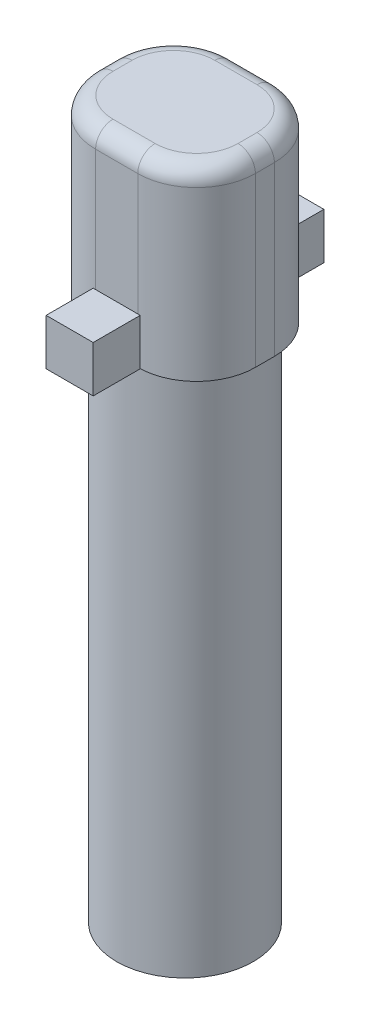
ISO-10303-21;
HEADER;
FILE_DESCRIPTION(('STEP AP214'),'2;1');
FILE_NAME('part.step','',(''),(''),'','','');
FILE_SCHEMA(('AUTOMOTIVE_DESIGN { 1 0 10303 214 1 1 1 1 }'));
ENDSEC;
DATA;
#1=APPLICATION_CONTEXT('core data for automotive mechanical design processes');
#2=APPLICATION_PROTOCOL_DEFINITION('international standard','automotive_design',2000,#1);
#3=PRODUCT_CONTEXT('',#1,'mechanical');
#4=PRODUCT('Part','Part','',(#3));
#5=PRODUCT_RELATED_PRODUCT_CATEGORY('part','',(#4));
#6=PRODUCT_DEFINITION_FORMATION('','',#4);
#7=PRODUCT_DEFINITION_CONTEXT('part definition',#1,'design');
#8=PRODUCT_DEFINITION('design','',#6,#7);
#9=PRODUCT_DEFINITION_SHAPE('','',#8);
#10=(LENGTH_UNIT() NAMED_UNIT(*) SI_UNIT(.MILLI.,.METRE.));
#11=(NAMED_UNIT(*) PLANE_ANGLE_UNIT() SI_UNIT($,.RADIAN.));
#12=(NAMED_UNIT(*) SI_UNIT($,.STERADIAN.) SOLID_ANGLE_UNIT());
#13=UNCERTAINTY_MEASURE_WITH_UNIT(LENGTH_MEASURE(1.E-05),#10,'distance_accuracy_value','');
#14=(GEOMETRIC_REPRESENTATION_CONTEXT(3) GLOBAL_UNCERTAINTY_ASSIGNED_CONTEXT((#13)) GLOBAL_UNIT_ASSIGNED_CONTEXT((#10,
#11,#12)) REPRESENTATION_CONTEXT('',''));
#15=CARTESIAN_POINT('',(0.,0.,0.));
#16=DIRECTION('',(0.,0.,1.));
#17=DIRECTION('',(1.,0.,0.));
#18=AXIS2_PLACEMENT_3D('',#15,#16,#17);
#19=CARTESIAN_POINT('',(0.,22.686,0.));
#20=DIRECTION('',(0.,-1.,0.));
#21=DIRECTION('',(0.,0.,-1.));
#22=AXIS2_PLACEMENT_3D('',#19,#20,#21);
#23=CYLINDRICAL_SURFACE('',#22,2.95);
#24=CARTESIAN_POINT('',(0.,22.686,0.));
#25=DIRECTION('',(0.,1.,0.));
#26=DIRECTION('',(0.,0.,1.));
#27=AXIS2_PLACEMENT_3D('',#24,#25,#26);
#28=CIRCLE('',#27,2.95);
#29=CARTESIAN_POINT('',(0.,22.686,2.95));
#30=VERTEX_POINT('',#29);
#31=EDGE_CURVE('E291',#30,#30,#28,.T.);
#32=ORIENTED_EDGE('',*,*,#31,.F.);
#33=EDGE_LOOP('',(#32));
#34=FACE_BOUND('',#33,.T.);
#35=CARTESIAN_POINT('',(0.,0.,0.));
#36=DIRECTION('',(0.,1.,0.));
#37=DIRECTION('',(0.,0.,1.));
#38=AXIS2_PLACEMENT_3D('',#35,#36,#37);
#39=CIRCLE('',#38,2.95);
#40=CARTESIAN_POINT('',(0.,0.,2.95));
#41=VERTEX_POINT('',#40);
#42=EDGE_CURVE('E290',#41,#41,#39,.T.);
#43=ORIENTED_EDGE('',*,*,#42,.T.);
#44=EDGE_LOOP('',(#43));
#45=FACE_BOUND('',#44,.T.);
#46=ADVANCED_FACE('F47',(#34,#45),#23,.T.);
#47=CARTESIAN_POINT('',(0.,0.,0.));
#48=DIRECTION('',(0.,1.,0.));
#49=DIRECTION('',(0.,0.,1.));
#50=AXIS2_PLACEMENT_3D('',#47,#48,#49);
#51=PLANE('',#50);
#52=ORIENTED_EDGE('',*,*,#42,.F.);
#53=EDGE_LOOP('',(#52));
#54=FACE_BOUND('',#53,.T.);
#55=ADVANCED_FACE('F505',(#54),#51,.F.);
#56=CARTESIAN_POINT('',(0.,22.686,0.));
#57=DIRECTION('',(0.,1.,0.));
#58=DIRECTION('',(0.,0.,1.));
#59=AXIS2_PLACEMENT_3D('',#56,#57,#58);
#60=PLANE('',#59);
#61=ORIENTED_EDGE('',*,*,#31,.T.);
#62=EDGE_LOOP('',(#61));
#63=FACE_BOUND('',#62,.T.);
#64=DIRECTION('',(1.,0.,0.));
#65=VECTOR('',#64,1.);
#66=CARTESIAN_POINT('',(0.,22.686,-2.95));
#67=LINE('',#66,#65);
#68=CARTESIAN_POINT('',(0.909999999999997,22.686,-2.95));
#69=VERTEX_POINT('',#68);
#70=CARTESIAN_POINT('',(1.016,22.686,-2.95));
#71=VERTEX_POINT('',#70);
#72=EDGE_CURVE('E222',#69,#71,#67,.T.);
#73=ORIENTED_EDGE('',*,*,#72,.F.);
#74=CARTESIAN_POINT('',(0.909999999999998,22.686,-0.41));
#75=DIRECTION('',(0.,1.,0.));
#76=DIRECTION('',(0.,0.,1.));
#77=AXIS2_PLACEMENT_3D('',#74,#75,#76);
#78=CIRCLE('',#77,2.54);
#79=CARTESIAN_POINT('',(3.45,22.686,-0.410000000000001));
#80=VERTEX_POINT('',#79);
#81=EDGE_CURVE('E322',#69,#80,#78,.F.);
#82=ORIENTED_EDGE('',*,*,#81,.T.);
#83=DIRECTION('',(0.,0.,-1.));
#84=VECTOR('',#83,1.);
#85=CARTESIAN_POINT('',(3.45,22.686,-2.95));
#86=LINE('',#85,#84);
#87=CARTESIAN_POINT('',(3.45,22.686,0.409999999999999));
#88=VERTEX_POINT('',#87);
#89=EDGE_CURVE('E282',#88,#80,#86,.T.);
#90=ORIENTED_EDGE('',*,*,#89,.F.);
#91=CARTESIAN_POINT('',(0.909999999999999,22.686,0.409999999999999));
#92=DIRECTION('',(0.,1.,0.));
#93=DIRECTION('',(0.,0.,1.));
#94=AXIS2_PLACEMENT_3D('',#91,#92,#93);
#95=CIRCLE('',#94,2.54);
#96=CARTESIAN_POINT('',(0.909999999999999,22.686,2.95));
#97=VERTEX_POINT('',#96);
#98=EDGE_CURVE('E319',#88,#97,#95,.F.);
#99=ORIENTED_EDGE('',*,*,#98,.T.);
#100=DIRECTION('',(-1.,0.,0.));
#101=VECTOR('',#100,1.);
#102=CARTESIAN_POINT('',(0.,22.686,2.95));
#103=LINE('',#102,#101);
#104=CARTESIAN_POINT('',(1.016,22.686,2.95));
#105=VERTEX_POINT('',#104);
#106=EDGE_CURVE('E260',#105,#97,#103,.T.);
#107=ORIENTED_EDGE('',*,*,#106,.F.);
#108=DIRECTION('',(0.,0.,-1.));
#109=VECTOR('',#108,1.);
#110=CARTESIAN_POINT('',(1.016,22.686,0.));
#111=LINE('',#110,#109);
#112=CARTESIAN_POINT('',(1.016,22.686,4.982));
#113=VERTEX_POINT('',#112);
#114=EDGE_CURVE('E264',#113,#105,#111,.T.);
#115=ORIENTED_EDGE('',*,*,#114,.F.);
#116=DIRECTION('',(1.,0.,0.));
#117=VECTOR('',#116,1.);
#118=CARTESIAN_POINT('',(0.,22.686,4.982));
#119=LINE('',#118,#117);
#120=CARTESIAN_POINT('',(-1.016,22.686,4.982));
#121=VERTEX_POINT('',#120);
#122=EDGE_CURVE('E252',#121,#113,#119,.T.);
#123=ORIENTED_EDGE('',*,*,#122,.F.);
#124=DIRECTION('',(0.,0.,1.));
#125=VECTOR('',#124,1.);
#126=CARTESIAN_POINT('',(-1.016,22.686,0.));
#127=LINE('',#126,#125);
#128=CARTESIAN_POINT('',(-1.016,22.686,2.95));
#129=VERTEX_POINT('',#128);
#130=EDGE_CURVE('E255',#129,#121,#127,.T.);
#131=ORIENTED_EDGE('',*,*,#130,.F.);
#132=CARTESIAN_POINT('',(-0.91,22.686,2.95));
#133=VERTEX_POINT('',#132);
#134=EDGE_CURVE('E259',#133,#129,#103,.T.);
#135=ORIENTED_EDGE('',*,*,#134,.F.);
#136=CARTESIAN_POINT('',(-0.910000000000001,22.686,0.409999999999999));
#137=DIRECTION('',(0.,1.,0.));
#138=DIRECTION('',(0.,0.,1.));
#139=AXIS2_PLACEMENT_3D('',#136,#137,#138);
#140=CIRCLE('',#139,2.54);
#141=CARTESIAN_POINT('',(-3.45,22.686,0.41));
#142=VERTEX_POINT('',#141);
#143=EDGE_CURVE('E305',#133,#142,#140,.F.);
#144=ORIENTED_EDGE('',*,*,#143,.T.);
#145=DIRECTION('',(0.,0.,1.));
#146=VECTOR('',#145,1.);
#147=CARTESIAN_POINT('',(-3.45,22.686,-2.95));
#148=LINE('',#147,#146);
#149=CARTESIAN_POINT('',(-3.45,22.686,-0.41));
#150=VERTEX_POINT('',#149);
#151=EDGE_CURVE('E286',#150,#142,#148,.T.);
#152=ORIENTED_EDGE('',*,*,#151,.F.);
#153=CARTESIAN_POINT('',(-0.910000000000001,22.686,-0.41));
#154=DIRECTION('',(0.,1.,0.));
#155=DIRECTION('',(0.,0.,1.));
#156=AXIS2_PLACEMENT_3D('',#153,#154,#155);
#157=CIRCLE('',#156,2.54);
#158=CARTESIAN_POINT('',(-0.910000000000001,22.686,-2.95));
#159=VERTEX_POINT('',#158);
#160=EDGE_CURVE('E308',#150,#159,#157,.F.);
#161=ORIENTED_EDGE('',*,*,#160,.T.);
#162=CARTESIAN_POINT('',(-1.016,22.686,-2.95));
#163=VERTEX_POINT('',#162);
#164=EDGE_CURVE('E461',#163,#159,#67,.T.);
#165=ORIENTED_EDGE('',*,*,#164,.F.);
#166=DIRECTION('',(0.,0.,1.));
#167=VECTOR('',#166,1.);
#168=CARTESIAN_POINT('',(-1.016,22.686,0.));
#169=LINE('',#168,#167);
#170=CARTESIAN_POINT('',(-1.016,22.686,-4.982));
#171=VERTEX_POINT('',#170);
#172=EDGE_CURVE('E207',#171,#163,#169,.T.);
#173=ORIENTED_EDGE('',*,*,#172,.F.);
#174=DIRECTION('',(-1.,0.,0.));
#175=VECTOR('',#174,1.);
#176=CARTESIAN_POINT('',(0.,22.686,-4.982));
#177=LINE('',#176,#175);
#178=CARTESIAN_POINT('',(1.016,22.686,-4.982));
#179=VERTEX_POINT('',#178);
#180=EDGE_CURVE('E466',#179,#171,#177,.T.);
#181=ORIENTED_EDGE('',*,*,#180,.F.);
#182=DIRECTION('',(0.,0.,-1.));
#183=VECTOR('',#182,1.);
#184=CARTESIAN_POINT('',(1.016,22.686,0.));
#185=LINE('',#184,#183);
#186=EDGE_CURVE('E464',#71,#179,#185,.T.);
#187=ORIENTED_EDGE('',*,*,#186,.F.);
#188=EDGE_LOOP('',(#73,#82,#90,#99,#107,#115,#123,#131,#135,#144,#152,#161,#165,#173,#181,#187));
#189=FACE_BOUND('',#188,.T.);
#190=ADVANCED_FACE('F438',(#63,#189),#60,.F.);
#191=CARTESIAN_POINT('',(3.45,30.686,-2.95));
#192=DIRECTION('',(-1.,0.,0.));
#193=DIRECTION('',(0.,0.,1.));
#194=AXIS2_PLACEMENT_3D('',#191,#192,#193);
#195=PLANE('',#194);
#196=DIRECTION('',(0.,-1.,0.));
#197=VECTOR('',#196,1.);
#198=CARTESIAN_POINT('',(3.45,30.686,-0.410000000000001));
#199=LINE('',#198,#197);
#200=CARTESIAN_POINT('',(3.45,29.936,-0.410000000000001));
#201=VERTEX_POINT('',#200);
#202=EDGE_CURVE('E328',#80,#201,#199,.F.);
#203=ORIENTED_EDGE('',*,*,#202,.T.);
#204=DIRECTION('',(0.,0.,-1.));
#205=VECTOR('',#204,1.);
#206=CARTESIAN_POINT('',(3.45,29.936,0.409999999999999));
#207=LINE('',#206,#205);
#208=CARTESIAN_POINT('',(3.45,29.936,0.409999999999999));
#209=VERTEX_POINT('',#208);
#210=EDGE_CURVE('E367',#201,#209,#207,.F.);
#211=ORIENTED_EDGE('',*,*,#210,.T.);
#212=DIRECTION('',(0.,-1.,0.));
#213=VECTOR('',#212,1.);
#214=CARTESIAN_POINT('',(3.45,30.686,0.409999999999999));
#215=LINE('',#214,#213);
#216=EDGE_CURVE('E325',#209,#88,#215,.T.);
#217=ORIENTED_EDGE('',*,*,#216,.T.);
#218=ORIENTED_EDGE('',*,*,#89,.T.);
#219=EDGE_LOOP('',(#203,#211,#217,#218));
#220=FACE_BOUND('',#219,.T.);
#221=ADVANCED_FACE('F583',(#220),#195,.F.);
#222=CARTESIAN_POINT('',(-3.45,30.686,-2.95));
#223=DIRECTION('',(0.,0.,1.));
#224=DIRECTION('',(1.,0.,0.));
#225=AXIS2_PLACEMENT_3D('',#222,#223,#224);
#226=PLANE('',#225);
#227=DIRECTION('',(0.,-1.,0.));
#228=VECTOR('',#227,1.);
#229=CARTESIAN_POINT('',(0.909999999999998,30.686,-2.95));
#230=LINE('',#229,#228);
#231=CARTESIAN_POINT('',(0.909999999999998,29.936,-2.95));
#232=VERTEX_POINT('',#231);
#233=CARTESIAN_POINT('',(0.909999999999998,24.686,-2.95));
#234=VERTEX_POINT('',#233);
#235=EDGE_CURVE('E311',#232,#234,#230,.T.);
#236=ORIENTED_EDGE('',*,*,#235,.T.);
#237=DIRECTION('',(1.,0.,0.));
#238=VECTOR('',#237,1.);
#239=CARTESIAN_POINT('',(0.,24.686,-2.95));
#240=LINE('',#239,#238);
#241=CARTESIAN_POINT('',(-0.910000000000001,24.686,-2.95));
#242=VERTEX_POINT('',#241);
#243=EDGE_CURVE('E65',#242,#234,#240,.T.);
#244=ORIENTED_EDGE('',*,*,#243,.F.);
#245=DIRECTION('',(0.,-1.,0.));
#246=VECTOR('',#245,1.);
#247=CARTESIAN_POINT('',(-0.910000000000001,30.686,-2.95));
#248=LINE('',#247,#246);
#249=CARTESIAN_POINT('',(-0.910000000000001,29.936,-2.95));
#250=VERTEX_POINT('',#249);
#251=EDGE_CURVE('E314',#242,#250,#248,.F.);
#252=ORIENTED_EDGE('',*,*,#251,.T.);
#253=DIRECTION('',(-1.,0.,0.));
#254=VECTOR('',#253,1.);
#255=CARTESIAN_POINT('',(0.909999999999998,29.936,-2.95));
#256=LINE('',#255,#254);
#257=EDGE_CURVE('E378',#250,#232,#256,.F.);
#258=ORIENTED_EDGE('',*,*,#257,.T.);
#259=EDGE_LOOP('',(#236,#244,#252,#258));
#260=FACE_BOUND('',#259,.T.);
#261=ADVANCED_FACE('F577',(#260),#226,.F.);
#262=CARTESIAN_POINT('',(-3.45,30.686,-2.95));
#263=DIRECTION('',(1.,0.,0.));
#264=DIRECTION('',(0.,0.,-1.));
#265=AXIS2_PLACEMENT_3D('',#262,#263,#264);
#266=PLANE('',#265);
#267=DIRECTION('',(0.,-1.,0.));
#268=VECTOR('',#267,1.);
#269=CARTESIAN_POINT('',(-3.45,30.686,0.41));
#270=LINE('',#269,#268);
#271=CARTESIAN_POINT('',(-3.45,29.936,0.41));
#272=VERTEX_POINT('',#271);
#273=EDGE_CURVE('E295',#142,#272,#270,.F.);
#274=ORIENTED_EDGE('',*,*,#273,.T.);
#275=DIRECTION('',(0.,0.,1.));
#276=VECTOR('',#275,1.);
#277=CARTESIAN_POINT('',(-3.45,29.936,-0.41));
#278=LINE('',#277,#276);
#279=CARTESIAN_POINT('',(-3.45,29.936,-0.41));
#280=VERTEX_POINT('',#279);
#281=EDGE_CURVE('E385',#272,#280,#278,.F.);
#282=ORIENTED_EDGE('',*,*,#281,.T.);
#283=DIRECTION('',(0.,-1.,0.));
#284=VECTOR('',#283,1.);
#285=CARTESIAN_POINT('',(-3.45,30.686,-0.41));
#286=LINE('',#285,#284);
#287=EDGE_CURVE('E302',#280,#150,#286,.T.);
#288=ORIENTED_EDGE('',*,*,#287,.T.);
#289=ORIENTED_EDGE('',*,*,#151,.T.);
#290=EDGE_LOOP('',(#274,#282,#288,#289));
#291=FACE_BOUND('',#290,.T.);
#292=ADVANCED_FACE('F427',(#291),#266,.F.);
#293=CARTESIAN_POINT('',(-3.45,30.686,2.95));
#294=DIRECTION('',(0.,0.,-1.));
#295=DIRECTION('',(-1.,0.,0.));
#296=AXIS2_PLACEMENT_3D('',#293,#294,#295);
#297=PLANE('',#296);
#298=DIRECTION('',(0.,-1.,0.));
#299=VECTOR('',#298,1.);
#300=CARTESIAN_POINT('',(-0.910000000000001,30.686,2.95));
#301=LINE('',#300,#299);
#302=CARTESIAN_POINT('',(-0.910000000000001,29.936,2.95));
#303=VERTEX_POINT('',#302);
#304=CARTESIAN_POINT('',(-0.910000000000001,24.686,2.95));
#305=VERTEX_POINT('',#304);
#306=EDGE_CURVE('E333',#303,#305,#301,.T.);
#307=ORIENTED_EDGE('',*,*,#306,.T.);
#308=DIRECTION('',(-1.,0.,0.));
#309=VECTOR('',#308,1.);
#310=CARTESIAN_POINT('',(0.,24.686,2.95));
#311=LINE('',#310,#309);
#312=CARTESIAN_POINT('',(0.909999999999999,24.686,2.95));
#313=VERTEX_POINT('',#312);
#314=EDGE_CURVE('E278',#313,#305,#311,.T.);
#315=ORIENTED_EDGE('',*,*,#314,.F.);
#316=DIRECTION('',(0.,-1.,0.));
#317=VECTOR('',#316,1.);
#318=CARTESIAN_POINT('',(0.909999999999999,30.686,2.95));
#319=LINE('',#318,#317);
#320=CARTESIAN_POINT('',(0.909999999999999,29.936,2.95));
#321=VERTEX_POINT('',#320);
#322=EDGE_CURVE('E337',#313,#321,#319,.F.);
#323=ORIENTED_EDGE('',*,*,#322,.T.);
#324=DIRECTION('',(1.,0.,0.));
#325=VECTOR('',#324,1.);
#326=CARTESIAN_POINT('',(-0.910000000000001,29.936,2.95));
#327=LINE('',#326,#325);
#328=EDGE_CURVE('E11',#321,#303,#327,.F.);
#329=ORIENTED_EDGE('',*,*,#328,.T.);
#330=EDGE_LOOP('',(#307,#315,#323,#329));
#331=FACE_BOUND('',#330,.T.);
#332=ADVANCED_FACE('F446',(#331),#297,.F.);
#333=CARTESIAN_POINT('',(0.,30.686,0.));
#334=DIRECTION('',(0.,1.,0.));
#335=DIRECTION('',(0.,0.,1.));
#336=AXIS2_PLACEMENT_3D('',#333,#334,#335);
#337=PLANE('',#336);
#338=CARTESIAN_POINT('',(0.909999999999999,30.686,0.409999999999999));
#339=DIRECTION('',(0.,1.,0.));
#340=DIRECTION('',(0.,0.,1.));
#341=AXIS2_PLACEMENT_3D('',#338,#339,#340);
#342=CIRCLE('',#341,1.79);
#343=CARTESIAN_POINT('',(0.909999999999999,30.686,2.2));
#344=VERTEX_POINT('',#343);
#345=CARTESIAN_POINT('',(2.7,30.686,0.409999999999999));
#346=VERTEX_POINT('',#345);
#347=EDGE_CURVE('E360',#344,#346,#342,.T.);
#348=ORIENTED_EDGE('',*,*,#347,.T.);
#349=DIRECTION('',(0.,0.,-1.));
#350=VECTOR('',#349,1.);
#351=CARTESIAN_POINT('',(2.7,30.686,-0.410000000000001));
#352=LINE('',#351,#350);
#353=CARTESIAN_POINT('',(2.7,30.686,-0.410000000000001));
#354=VERTEX_POINT('',#353);
#355=EDGE_CURVE('E363',#346,#354,#352,.T.);
#356=ORIENTED_EDGE('',*,*,#355,.T.);
#357=CARTESIAN_POINT('',(0.909999999999998,30.686,-0.41));
#358=DIRECTION('',(0.,1.,0.));
#359=DIRECTION('',(0.,0.,1.));
#360=AXIS2_PLACEMENT_3D('',#357,#358,#359);
#361=CIRCLE('',#360,1.79);
#362=CARTESIAN_POINT('',(0.909999999999998,30.686,-2.2));
#363=VERTEX_POINT('',#362);
#364=EDGE_CURVE('E357',#354,#363,#361,.T.);
#365=ORIENTED_EDGE('',*,*,#364,.T.);
#366=DIRECTION('',(-1.,0.,0.));
#367=VECTOR('',#366,1.);
#368=CARTESIAN_POINT('',(-0.910000000000001,30.686,-2.2));
#369=LINE('',#368,#367);
#370=CARTESIAN_POINT('',(-0.910000000000001,30.686,-2.2));
#371=VERTEX_POINT('',#370);
#372=EDGE_CURVE('E354',#363,#371,#369,.T.);
#373=ORIENTED_EDGE('',*,*,#372,.T.);
#374=CARTESIAN_POINT('',(-0.910000000000001,30.686,-0.41));
#375=DIRECTION('',(0.,1.,0.));
#376=DIRECTION('',(0.,0.,1.));
#377=AXIS2_PLACEMENT_3D('',#374,#375,#376);
#378=CIRCLE('',#377,1.79);
#379=CARTESIAN_POINT('',(-2.7,30.686,-0.41));
#380=VERTEX_POINT('',#379);
#381=EDGE_CURVE('E351',#371,#380,#378,.T.);
#382=ORIENTED_EDGE('',*,*,#381,.T.);
#383=DIRECTION('',(0.,0.,1.));
#384=VECTOR('',#383,1.);
#385=CARTESIAN_POINT('',(-2.7,30.686,0.41));
#386=LINE('',#385,#384);
#387=CARTESIAN_POINT('',(-2.7,30.686,0.41));
#388=VERTEX_POINT('',#387);
#389=EDGE_CURVE('E348',#380,#388,#386,.T.);
#390=ORIENTED_EDGE('',*,*,#389,.T.);
#391=CARTESIAN_POINT('',(-0.910000000000001,30.686,0.409999999999999));
#392=DIRECTION('',(0.,1.,0.));
#393=DIRECTION('',(0.,0.,1.));
#394=AXIS2_PLACEMENT_3D('',#391,#392,#393);
#395=CIRCLE('',#394,1.79);
#396=CARTESIAN_POINT('',(-0.910000000000001,30.686,2.2));
#397=VERTEX_POINT('',#396);
#398=EDGE_CURVE('E345',#388,#397,#395,.T.);
#399=ORIENTED_EDGE('',*,*,#398,.T.);
#400=DIRECTION('',(1.,0.,0.));
#401=VECTOR('',#400,1.);
#402=CARTESIAN_POINT('',(0.909999999999999,30.686,2.2));
#403=LINE('',#402,#401);
#404=EDGE_CURVE('E342',#397,#344,#403,.T.);
#405=ORIENTED_EDGE('',*,*,#404,.T.);
#406=EDGE_LOOP('',(#348,#356,#365,#373,#382,#390,#399,#405));
#407=FACE_BOUND('',#406,.T.);
#408=ADVANCED_FACE('F522',(#407),#337,.T.);
#409=CARTESIAN_POINT('',(-0.910000000000001,30.686,-0.41));
#410=DIRECTION('',(0.,-1.,0.));
#411=DIRECTION('',(0.,0.,-1.));
#412=AXIS2_PLACEMENT_3D('',#409,#410,#411);
#413=CYLINDRICAL_SURFACE('',#412,2.54);
#414=ORIENTED_EDGE('',*,*,#287,.F.);
#415=CARTESIAN_POINT('',(-0.910000000000001,29.936,-0.41));
#416=DIRECTION('',(0.,1.,0.));
#417=DIRECTION('',(0.,0.,1.));
#418=AXIS2_PLACEMENT_3D('',#415,#416,#417);
#419=CIRCLE('',#418,2.54);
#420=EDGE_CURVE('E381',#280,#250,#419,.F.);
#421=ORIENTED_EDGE('',*,*,#420,.T.);
#422=ORIENTED_EDGE('',*,*,#251,.F.);
#423=EDGE_CURVE('E315',#159,#242,#248,.F.);
#424=ORIENTED_EDGE('',*,*,#423,.F.);
#425=ORIENTED_EDGE('',*,*,#160,.F.);
#426=EDGE_LOOP('',(#414,#421,#422,#424,#425));
#427=FACE_BOUND('',#426,.T.);
#428=ADVANCED_FACE('F431',(#427),#413,.T.);
#429=CARTESIAN_POINT('',(0.909999999999998,30.686,-0.41));
#430=DIRECTION('',(0.,-1.,0.));
#431=DIRECTION('',(0.,0.,-1.));
#432=AXIS2_PLACEMENT_3D('',#429,#430,#431);
#433=CYLINDRICAL_SURFACE('',#432,2.54);
#434=ORIENTED_EDGE('',*,*,#235,.F.);
#435=CARTESIAN_POINT('',(0.909999999999998,29.936,-0.41));
#436=DIRECTION('',(0.,1.,0.));
#437=DIRECTION('',(0.,0.,1.));
#438=AXIS2_PLACEMENT_3D('',#435,#436,#437);
#439=CIRCLE('',#438,2.54);
#440=EDGE_CURVE('E375',#232,#201,#439,.F.);
#441=ORIENTED_EDGE('',*,*,#440,.T.);
#442=ORIENTED_EDGE('',*,*,#202,.F.);
#443=ORIENTED_EDGE('',*,*,#81,.F.);
#444=EDGE_CURVE('E73',#234,#69,#230,.T.);
#445=ORIENTED_EDGE('',*,*,#444,.F.);
#446=EDGE_LOOP('',(#434,#441,#442,#443,#445));
#447=FACE_BOUND('',#446,.T.);
#448=ADVANCED_FACE('F521',(#447),#433,.T.);
#449=CARTESIAN_POINT('',(0.909999999999999,30.686,0.409999999999999));
#450=DIRECTION('',(0.,-1.,0.));
#451=DIRECTION('',(0.,0.,-1.));
#452=AXIS2_PLACEMENT_3D('',#449,#450,#451);
#453=CYLINDRICAL_SURFACE('',#452,2.54);
#454=ORIENTED_EDGE('',*,*,#216,.F.);
#455=CARTESIAN_POINT('',(0.909999999999999,29.936,0.409999999999999));
#456=DIRECTION('',(0.,1.,0.));
#457=DIRECTION('',(0.,0.,1.));
#458=AXIS2_PLACEMENT_3D('',#455,#456,#457);
#459=CIRCLE('',#458,2.54);
#460=EDGE_CURVE('E371',#209,#321,#459,.F.);
#461=ORIENTED_EDGE('',*,*,#460,.T.);
#462=ORIENTED_EDGE('',*,*,#322,.F.);
#463=EDGE_CURVE('E338',#97,#313,#319,.F.);
#464=ORIENTED_EDGE('',*,*,#463,.F.);
#465=ORIENTED_EDGE('',*,*,#98,.F.);
#466=EDGE_LOOP('',(#454,#461,#462,#464,#465));
#467=FACE_BOUND('',#466,.T.);
#468=ADVANCED_FACE('F525',(#467),#453,.T.);
#469=CARTESIAN_POINT('',(-0.910000000000001,30.686,0.409999999999999));
#470=DIRECTION('',(0.,-1.,0.));
#471=DIRECTION('',(0.,0.,-1.));
#472=AXIS2_PLACEMENT_3D('',#469,#470,#471);
#473=CYLINDRICAL_SURFACE('',#472,2.54);
#474=ORIENTED_EDGE('',*,*,#306,.F.);
#475=CARTESIAN_POINT('',(-0.910000000000001,29.936,0.409999999999999));
#476=DIRECTION('',(0.,1.,0.));
#477=DIRECTION('',(0.,0.,1.));
#478=AXIS2_PLACEMENT_3D('',#475,#476,#477);
#479=CIRCLE('',#478,2.54);
#480=EDGE_CURVE('E57',#303,#272,#479,.F.);
#481=ORIENTED_EDGE('',*,*,#480,.T.);
#482=ORIENTED_EDGE('',*,*,#273,.F.);
#483=ORIENTED_EDGE('',*,*,#143,.F.);
#484=EDGE_CURVE('E332',#305,#133,#301,.T.);
#485=ORIENTED_EDGE('',*,*,#484,.F.);
#486=EDGE_LOOP('',(#474,#481,#482,#483,#485));
#487=FACE_BOUND('',#486,.T.);
#488=ADVANCED_FACE('F442',(#487),#473,.T.);
#489=CARTESIAN_POINT('',(-2.7,29.936,0.));
#490=DIRECTION('',(0.,0.,-1.));
#491=DIRECTION('',(-1.,0.,0.));
#492=AXIS2_PLACEMENT_3D('',#489,#490,#491);
#493=CYLINDRICAL_SURFACE('',#492,0.75);
#494=CARTESIAN_POINT('',(-2.7,29.936,-0.41));
#495=DIRECTION('',(0.,0.,-1.));
#496=DIRECTION('',(-1.,0.,0.));
#497=AXIS2_PLACEMENT_3D('',#494,#495,#496);
#498=CIRCLE('',#497,0.75);
#499=EDGE_CURVE('E407',#280,#380,#498,.T.);
#500=ORIENTED_EDGE('',*,*,#499,.F.);
#501=ORIENTED_EDGE('',*,*,#281,.F.);
#502=CARTESIAN_POINT('',(-2.7,29.936,0.41));
#503=DIRECTION('',(0.,0.,1.));
#504=DIRECTION('',(1.,0.,0.));
#505=AXIS2_PLACEMENT_3D('',#502,#503,#504);
#506=CIRCLE('',#505,0.75);
#507=EDGE_CURVE('E51',#388,#272,#506,.T.);
#508=ORIENTED_EDGE('',*,*,#507,.F.);
#509=ORIENTED_EDGE('',*,*,#389,.F.);
#510=EDGE_LOOP('',(#500,#501,#508,#509));
#511=FACE_BOUND('',#510,.T.);
#512=ADVANCED_FACE('F49',(#511),#493,.T.);
#513=CARTESIAN_POINT('',(-0.910000000000001,29.936,0.409999999999999));
#514=DIRECTION('',(0.,1.,0.));
#515=DIRECTION('',(0.,0.,1.));
#516=AXIS2_PLACEMENT_3D('',#513,#514,#515);
#517=TOROIDAL_SURFACE('',#516,1.79,0.75);
#518=ORIENTED_EDGE('',*,*,#507,.T.);
#519=ORIENTED_EDGE('',*,*,#480,.F.);
#520=CARTESIAN_POINT('',(-0.910000000000001,29.936,2.2));
#521=DIRECTION('',(1.,0.,0.));
#522=DIRECTION('',(0.,0.,-1.));
#523=AXIS2_PLACEMENT_3D('',#520,#521,#522);
#524=CIRCLE('',#523,0.75);
#525=EDGE_CURVE('E404',#397,#303,#524,.T.);
#526=ORIENTED_EDGE('',*,*,#525,.F.);
#527=ORIENTED_EDGE('',*,*,#398,.F.);
#528=EDGE_LOOP('',(#518,#519,#526,#527));
#529=FACE_BOUND('',#528,.T.);
#530=ADVANCED_FACE('F420',(#529),#517,.T.);
#531=CARTESIAN_POINT('',(-0.910000000000001,29.936,-0.41));
#532=DIRECTION('',(0.,1.,0.));
#533=DIRECTION('',(0.,0.,1.));
#534=AXIS2_PLACEMENT_3D('',#531,#532,#533);
#535=TOROIDAL_SURFACE('',#534,1.79,0.75);
#536=ORIENTED_EDGE('',*,*,#499,.T.);
#537=ORIENTED_EDGE('',*,*,#381,.F.);
#538=CARTESIAN_POINT('',(-0.910000000000001,29.936,-2.2));
#539=DIRECTION('',(1.,0.,0.));
#540=DIRECTION('',(0.,0.,-1.));
#541=AXIS2_PLACEMENT_3D('',#538,#539,#540);
#542=CIRCLE('',#541,0.75);
#543=EDGE_CURVE('E400',#250,#371,#542,.T.);
#544=ORIENTED_EDGE('',*,*,#543,.F.);
#545=ORIENTED_EDGE('',*,*,#420,.F.);
#546=EDGE_LOOP('',(#536,#537,#544,#545));
#547=FACE_BOUND('',#546,.T.);
#548=ADVANCED_FACE('F550',(#547),#535,.T.);
#549=CARTESIAN_POINT('',(0.,29.936,2.2));
#550=DIRECTION('',(-1.,0.,0.));
#551=DIRECTION('',(0.,0.,1.));
#552=AXIS2_PLACEMENT_3D('',#549,#550,#551);
#553=CYLINDRICAL_SURFACE('',#552,0.75);
#554=ORIENTED_EDGE('',*,*,#525,.T.);
#555=ORIENTED_EDGE('',*,*,#328,.F.);
#556=CARTESIAN_POINT('',(0.909999999999999,29.936,2.2));
#557=DIRECTION('',(1.,0.,0.));
#558=DIRECTION('',(0.,0.,-1.));
#559=AXIS2_PLACEMENT_3D('',#556,#557,#558);
#560=CIRCLE('',#559,0.75);
#561=EDGE_CURVE('E396',#344,#321,#560,.T.);
#562=ORIENTED_EDGE('',*,*,#561,.F.);
#563=ORIENTED_EDGE('',*,*,#404,.F.);
#564=EDGE_LOOP('',(#554,#555,#562,#563));
#565=FACE_BOUND('',#564,.T.);
#566=ADVANCED_FACE('F546',(#565),#553,.T.);
#567=CARTESIAN_POINT('',(0.,29.936,-2.2));
#568=DIRECTION('',(1.,0.,0.));
#569=DIRECTION('',(0.,0.,-1.));
#570=AXIS2_PLACEMENT_3D('',#567,#568,#569);
#571=CYLINDRICAL_SURFACE('',#570,0.75);
#572=ORIENTED_EDGE('',*,*,#543,.T.);
#573=ORIENTED_EDGE('',*,*,#372,.F.);
#574=CARTESIAN_POINT('',(0.909999999999998,29.936,-2.2));
#575=DIRECTION('',(1.,0.,0.));
#576=DIRECTION('',(0.,0.,-1.));
#577=AXIS2_PLACEMENT_3D('',#574,#575,#576);
#578=CIRCLE('',#577,0.75);
#579=EDGE_CURVE('E392',#232,#363,#578,.T.);
#580=ORIENTED_EDGE('',*,*,#579,.F.);
#581=ORIENTED_EDGE('',*,*,#257,.F.);
#582=EDGE_LOOP('',(#572,#573,#580,#581));
#583=FACE_BOUND('',#582,.T.);
#584=ADVANCED_FACE('F542',(#583),#571,.T.);
#585=CARTESIAN_POINT('',(0.909999999999999,29.936,0.409999999999999));
#586=DIRECTION('',(0.,1.,0.));
#587=DIRECTION('',(0.,0.,1.));
#588=AXIS2_PLACEMENT_3D('',#585,#586,#587);
#589=TOROIDAL_SURFACE('',#588,1.79,0.75);
#590=ORIENTED_EDGE('',*,*,#561,.T.);
#591=ORIENTED_EDGE('',*,*,#460,.F.);
#592=CARTESIAN_POINT('',(2.7,29.936,0.409999999999999));
#593=DIRECTION('',(0.,0.,-1.));
#594=DIRECTION('',(-1.,0.,0.));
#595=AXIS2_PLACEMENT_3D('',#592,#593,#594);
#596=CIRCLE('',#595,0.75);
#597=EDGE_CURVE('E229',#346,#209,#596,.T.);
#598=ORIENTED_EDGE('',*,*,#597,.F.);
#599=ORIENTED_EDGE('',*,*,#347,.F.);
#600=EDGE_LOOP('',(#590,#591,#598,#599));
#601=FACE_BOUND('',#600,.T.);
#602=ADVANCED_FACE('F538',(#601),#589,.T.);
#603=CARTESIAN_POINT('',(0.909999999999998,29.936,-0.41));
#604=DIRECTION('',(0.,1.,0.));
#605=DIRECTION('',(0.,0.,1.));
#606=AXIS2_PLACEMENT_3D('',#603,#604,#605);
#607=TOROIDAL_SURFACE('',#606,1.79,0.75);
#608=ORIENTED_EDGE('',*,*,#579,.T.);
#609=ORIENTED_EDGE('',*,*,#364,.F.);
#610=CARTESIAN_POINT('',(2.7,29.936,-0.410000000000001));
#611=DIRECTION('',(0.,0.,1.));
#612=DIRECTION('',(1.,0.,0.));
#613=AXIS2_PLACEMENT_3D('',#610,#611,#612);
#614=CIRCLE('',#613,0.75);
#615=EDGE_CURVE('E225',#201,#354,#614,.T.);
#616=ORIENTED_EDGE('',*,*,#615,.F.);
#617=ORIENTED_EDGE('',*,*,#440,.F.);
#618=EDGE_LOOP('',(#608,#609,#616,#617));
#619=FACE_BOUND('',#618,.T.);
#620=ADVANCED_FACE('F534',(#619),#607,.T.);
#621=CARTESIAN_POINT('',(2.7,29.936,0.));
#622=DIRECTION('',(0.,0.,1.));
#623=DIRECTION('',(1.,0.,0.));
#624=AXIS2_PLACEMENT_3D('',#621,#622,#623);
#625=CYLINDRICAL_SURFACE('',#624,0.75);
#626=ORIENTED_EDGE('',*,*,#597,.T.);
#627=ORIENTED_EDGE('',*,*,#210,.F.);
#628=ORIENTED_EDGE('',*,*,#615,.T.);
#629=ORIENTED_EDGE('',*,*,#355,.F.);
#630=EDGE_LOOP('',(#626,#627,#628,#629));
#631=FACE_BOUND('',#630,.T.);
#632=ADVANCED_FACE('F531',(#631),#625,.T.);
#633=CARTESIAN_POINT('',(0.,24.686,2.95));
#634=DIRECTION('',(0.,0.,1.));
#635=DIRECTION('',(1.,0.,0.));
#636=AXIS2_PLACEMENT_3D('',#633,#634,#635);
#637=PLANE('',#636);
#638=ORIENTED_EDGE('',*,*,#106,.T.);
#639=ORIENTED_EDGE('',*,*,#463,.T.);
#640=CARTESIAN_POINT('',(1.016,24.686,2.95));
#641=VERTEX_POINT('',#640);
#642=EDGE_CURVE('E274',#641,#313,#311,.T.);
#643=ORIENTED_EDGE('',*,*,#642,.F.);
#644=DIRECTION('',(0.,-1.,0.));
#645=VECTOR('',#644,1.);
#646=CARTESIAN_POINT('',(1.016,24.686,2.95));
#647=LINE('',#646,#645);
#648=EDGE_CURVE('E235',#641,#105,#647,.T.);
#649=ORIENTED_EDGE('',*,*,#648,.T.);
#650=EDGE_LOOP('',(#638,#639,#643,#649));
#651=FACE_BOUND('',#650,.T.);
#652=ADVANCED_FACE('F533',(#651),#637,.F.);
#653=CARTESIAN_POINT('',(1.016,24.686,0.));
#654=DIRECTION('',(-1.,0.,0.));
#655=DIRECTION('',(0.,0.,1.));
#656=AXIS2_PLACEMENT_3D('',#653,#654,#655);
#657=PLANE('',#656);
#658=ORIENTED_EDGE('',*,*,#114,.T.);
#659=ORIENTED_EDGE('',*,*,#648,.F.);
#660=DIRECTION('',(0.,0.,-1.));
#661=VECTOR('',#660,1.);
#662=CARTESIAN_POINT('',(1.016,24.686,0.));
#663=LINE('',#662,#661);
#664=CARTESIAN_POINT('',(1.016,24.686,4.982));
#665=VERTEX_POINT('',#664);
#666=EDGE_CURVE('E256',#665,#641,#663,.T.);
#667=ORIENTED_EDGE('',*,*,#666,.F.);
#668=DIRECTION('',(0.,-1.,0.));
#669=VECTOR('',#668,1.);
#670=CARTESIAN_POINT('',(1.016,24.686,4.982));
#671=LINE('',#670,#669);
#672=EDGE_CURVE('E247',#665,#113,#671,.T.);
#673=ORIENTED_EDGE('',*,*,#672,.T.);
#674=EDGE_LOOP('',(#658,#659,#667,#673));
#675=FACE_BOUND('',#674,.T.);
#676=ADVANCED_FACE('F703',(#675),#657,.F.);
#677=ORIENTED_EDGE('',*,*,#484,.T.);
#678=ORIENTED_EDGE('',*,*,#134,.T.);
#679=DIRECTION('',(0.,-1.,0.));
#680=VECTOR('',#679,1.);
#681=CARTESIAN_POINT('',(-1.016,24.686,2.95));
#682=LINE('',#681,#680);
#683=CARTESIAN_POINT('',(-1.016,24.686,2.95));
#684=VERTEX_POINT('',#683);
#685=EDGE_CURVE('E239',#684,#129,#682,.T.);
#686=ORIENTED_EDGE('',*,*,#685,.F.);
#687=EDGE_CURVE('E273',#305,#684,#311,.T.);
#688=ORIENTED_EDGE('',*,*,#687,.F.);
#689=EDGE_LOOP('',(#677,#678,#686,#688));
#690=FACE_BOUND('',#689,.T.);
#691=ADVANCED_FACE('F452',(#690),#637,.F.);
#692=CARTESIAN_POINT('',(-1.016,24.686,0.));
#693=DIRECTION('',(1.,0.,0.));
#694=DIRECTION('',(0.,0.,-1.));
#695=AXIS2_PLACEMENT_3D('',#692,#693,#694);
#696=PLANE('',#695);
#697=ORIENTED_EDGE('',*,*,#130,.T.);
#698=DIRECTION('',(0.,-1.,0.));
#699=VECTOR('',#698,1.);
#700=CARTESIAN_POINT('',(-1.016,24.686,4.982));
#701=LINE('',#700,#699);
#702=CARTESIAN_POINT('',(-1.016,24.686,4.982));
#703=VERTEX_POINT('',#702);
#704=EDGE_CURVE('E243',#703,#121,#701,.T.);
#705=ORIENTED_EDGE('',*,*,#704,.F.);
#706=DIRECTION('',(0.,0.,1.));
#707=VECTOR('',#706,1.);
#708=CARTESIAN_POINT('',(-1.016,24.686,0.));
#709=LINE('',#708,#707);
#710=EDGE_CURVE('E270',#684,#703,#709,.T.);
#711=ORIENTED_EDGE('',*,*,#710,.F.);
#712=ORIENTED_EDGE('',*,*,#685,.T.);
#713=EDGE_LOOP('',(#697,#705,#711,#712));
#714=FACE_BOUND('',#713,.T.);
#715=ADVANCED_FACE('F719',(#714),#696,.F.);
#716=CARTESIAN_POINT('',(0.,24.686,4.982));
#717=DIRECTION('',(0.,0.,-1.));
#718=DIRECTION('',(-1.,0.,0.));
#719=AXIS2_PLACEMENT_3D('',#716,#717,#718);
#720=PLANE('',#719);
#721=ORIENTED_EDGE('',*,*,#122,.T.);
#722=ORIENTED_EDGE('',*,*,#672,.F.);
#723=DIRECTION('',(1.,0.,0.));
#724=VECTOR('',#723,1.);
#725=CARTESIAN_POINT('',(0.,24.686,4.982));
#726=LINE('',#725,#724);
#727=EDGE_CURVE('E251',#703,#665,#726,.T.);
#728=ORIENTED_EDGE('',*,*,#727,.F.);
#729=ORIENTED_EDGE('',*,*,#704,.T.);
#730=EDGE_LOOP('',(#721,#722,#728,#729));
#731=FACE_BOUND('',#730,.T.);
#732=ADVANCED_FACE('F726',(#731),#720,.F.);
#733=CARTESIAN_POINT('',(0.,24.686,0.));
#734=DIRECTION('',(0.,1.,0.));
#735=DIRECTION('',(0.,0.,1.));
#736=AXIS2_PLACEMENT_3D('',#733,#734,#735);
#737=PLANE('',#736);
#738=ORIENTED_EDGE('',*,*,#666,.T.);
#739=ORIENTED_EDGE('',*,*,#642,.T.);
#740=ORIENTED_EDGE('',*,*,#314,.T.);
#741=ORIENTED_EDGE('',*,*,#687,.T.);
#742=ORIENTED_EDGE('',*,*,#710,.T.);
#743=ORIENTED_EDGE('',*,*,#727,.T.);
#744=EDGE_LOOP('',(#738,#739,#740,#741,#742,#743));
#745=FACE_BOUND('',#744,.T.);
#746=ADVANCED_FACE('F456',(#745),#737,.T.);
#747=CARTESIAN_POINT('',(0.,24.686,-2.95));
#748=DIRECTION('',(0.,0.,-1.));
#749=DIRECTION('',(-1.,0.,0.));
#750=AXIS2_PLACEMENT_3D('',#747,#748,#749);
#751=PLANE('',#750);
#752=ORIENTED_EDGE('',*,*,#164,.T.);
#753=ORIENTED_EDGE('',*,*,#423,.T.);
#754=CARTESIAN_POINT('',(-1.016,24.686,-2.95));
#755=VERTEX_POINT('',#754);
#756=EDGE_CURVE('E209',#755,#242,#240,.T.);
#757=ORIENTED_EDGE('',*,*,#756,.F.);
#758=DIRECTION('',(0.,-1.,0.));
#759=VECTOR('',#758,1.);
#760=CARTESIAN_POINT('',(-1.016,24.686,-2.95));
#761=LINE('',#760,#759);
#762=EDGE_CURVE('E478',#755,#163,#761,.T.);
#763=ORIENTED_EDGE('',*,*,#762,.T.);
#764=EDGE_LOOP('',(#752,#753,#757,#763));
#765=FACE_BOUND('',#764,.T.);
#766=ADVANCED_FACE('F493',(#765),#751,.F.);
#767=ORIENTED_EDGE('',*,*,#444,.T.);
#768=ORIENTED_EDGE('',*,*,#72,.T.);
#769=DIRECTION('',(0.,-1.,0.));
#770=VECTOR('',#769,1.);
#771=CARTESIAN_POINT('',(1.016,24.686,-2.95));
#772=LINE('',#771,#770);
#773=CARTESIAN_POINT('',(1.016,24.686,-2.95));
#774=VERTEX_POINT('',#773);
#775=EDGE_CURVE('E213',#774,#71,#772,.T.);
#776=ORIENTED_EDGE('',*,*,#775,.F.);
#777=EDGE_CURVE('E198',#234,#774,#240,.T.);
#778=ORIENTED_EDGE('',*,*,#777,.F.);
#779=EDGE_LOOP('',(#767,#768,#776,#778));
#780=FACE_BOUND('',#779,.T.);
#781=ADVANCED_FACE('F220',(#780),#751,.F.);
#782=CARTESIAN_POINT('',(1.016,24.686,0.));
#783=DIRECTION('',(-1.,0.,0.));
#784=DIRECTION('',(0.,0.,1.));
#785=AXIS2_PLACEMENT_3D('',#782,#783,#784);
#786=PLANE('',#785);
#787=ORIENTED_EDGE('',*,*,#186,.T.);
#788=DIRECTION('',(0.,-1.,0.));
#789=VECTOR('',#788,1.);
#790=CARTESIAN_POINT('',(1.016,24.686,-4.982));
#791=LINE('',#790,#789);
#792=CARTESIAN_POINT('',(1.016,24.686,-4.982));
#793=VERTEX_POINT('',#792);
#794=EDGE_CURVE('E215',#793,#179,#791,.T.);
#795=ORIENTED_EDGE('',*,*,#794,.F.);
#796=DIRECTION('',(0.,0.,-1.));
#797=VECTOR('',#796,1.);
#798=CARTESIAN_POINT('',(1.016,24.686,0.));
#799=LINE('',#798,#797);
#800=EDGE_CURVE('E202',#774,#793,#799,.T.);
#801=ORIENTED_EDGE('',*,*,#800,.F.);
#802=ORIENTED_EDGE('',*,*,#775,.T.);
#803=EDGE_LOOP('',(#787,#795,#801,#802));
#804=FACE_BOUND('',#803,.T.);
#805=ADVANCED_FACE('F212',(#804),#786,.F.);
#806=CARTESIAN_POINT('',(0.,24.686,-4.982));
#807=DIRECTION('',(0.,0.,1.));
#808=DIRECTION('',(1.,0.,0.));
#809=AXIS2_PLACEMENT_3D('',#806,#807,#808);
#810=PLANE('',#809);
#811=ORIENTED_EDGE('',*,*,#180,.T.);
#812=DIRECTION('',(0.,-1.,0.));
#813=VECTOR('',#812,1.);
#814=CARTESIAN_POINT('',(-1.016,24.686,-4.982));
#815=LINE('',#814,#813);
#816=CARTESIAN_POINT('',(-1.016,24.686,-4.982));
#817=VERTEX_POINT('',#816);
#818=EDGE_CURVE('E231',#817,#171,#815,.T.);
#819=ORIENTED_EDGE('',*,*,#818,.F.);
#820=DIRECTION('',(-1.,0.,0.));
#821=VECTOR('',#820,1.);
#822=CARTESIAN_POINT('',(0.,24.686,-4.982));
#823=LINE('',#822,#821);
#824=EDGE_CURVE('E218',#793,#817,#823,.T.);
#825=ORIENTED_EDGE('',*,*,#824,.F.);
#826=ORIENTED_EDGE('',*,*,#794,.T.);
#827=EDGE_LOOP('',(#811,#819,#825,#826));
#828=FACE_BOUND('',#827,.T.);
#829=ADVANCED_FACE('F495',(#828),#810,.F.);
#830=CARTESIAN_POINT('',(-1.016,24.686,0.));
#831=DIRECTION('',(1.,0.,0.));
#832=DIRECTION('',(0.,0.,-1.));
#833=AXIS2_PLACEMENT_3D('',#830,#831,#832);
#834=PLANE('',#833);
#835=ORIENTED_EDGE('',*,*,#172,.T.);
#836=ORIENTED_EDGE('',*,*,#762,.F.);
#837=DIRECTION('',(0.,0.,1.));
#838=VECTOR('',#837,1.);
#839=CARTESIAN_POINT('',(-1.016,24.686,0.));
#840=LINE('',#839,#838);
#841=EDGE_CURVE('E475',#817,#755,#840,.T.);
#842=ORIENTED_EDGE('',*,*,#841,.F.);
#843=ORIENTED_EDGE('',*,*,#818,.T.);
#844=EDGE_LOOP('',(#835,#836,#842,#843));
#845=FACE_BOUND('',#844,.T.);
#846=ADVANCED_FACE('F488',(#845),#834,.F.);
#847=CARTESIAN_POINT('',(0.,24.686,0.));
#848=DIRECTION('',(0.,1.,0.));
#849=DIRECTION('',(0.,0.,1.));
#850=AXIS2_PLACEMENT_3D('',#847,#848,#849);
#851=PLANE('',#850);
#852=ORIENTED_EDGE('',*,*,#756,.T.);
#853=ORIENTED_EDGE('',*,*,#243,.T.);
#854=ORIENTED_EDGE('',*,*,#777,.T.);
#855=ORIENTED_EDGE('',*,*,#800,.T.);
#856=ORIENTED_EDGE('',*,*,#824,.T.);
#857=ORIENTED_EDGE('',*,*,#841,.T.);
#858=EDGE_LOOP('',(#852,#853,#854,#855,#856,#857));
#859=FACE_BOUND('',#858,.T.);
#860=ADVANCED_FACE('F201',(#859),#851,.T.);
#861=CLOSED_SHELL('',(#46,#55,#190,#221,#261,#292,#332,#408,#428,#448,#468,#488,#512,#530,#548,
#566,#584,#602,#620,#632,#652,#676,#691,#715,#732,#746,#766,#781,#805,#829,#846,#860));
#862=MANIFOLD_SOLID_BREP('B2',#861);
#863=ADVANCED_BREP_SHAPE_REPRESENTATION('',(#18,#862),#14);
#864=SHAPE_DEFINITION_REPRESENTATION(#9,#863);
ENDSEC;
END-ISO-10303-21;
